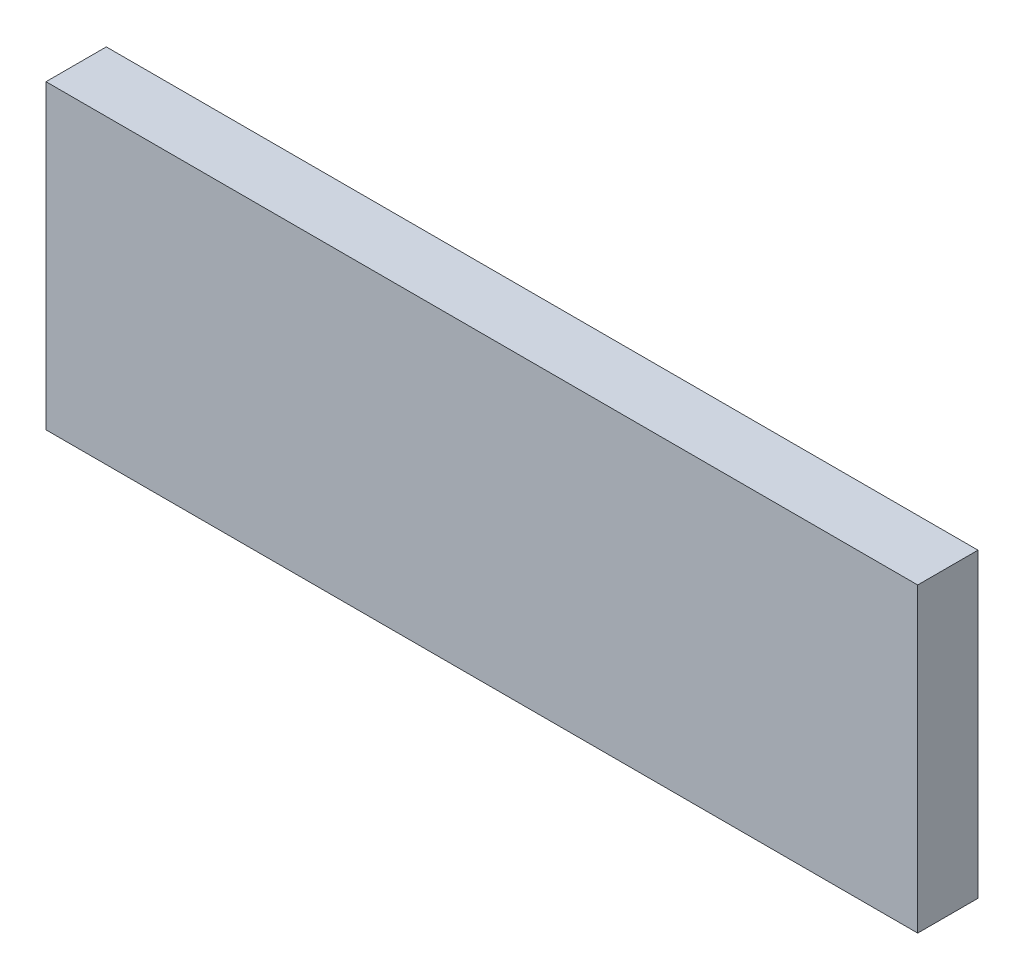
ISO-10303-21;
HEADER;
FILE_DESCRIPTION(('STEP AP214'),'2;1');
FILE_NAME('part.step','',(''),(''),'','','');
FILE_SCHEMA(('AUTOMOTIVE_DESIGN { 1 0 10303 214 1 1 1 1 }'));
ENDSEC;
DATA;
#1=APPLICATION_CONTEXT('core data for automotive mechanical design processes');
#2=APPLICATION_PROTOCOL_DEFINITION('international standard','automotive_design',2000,#1);
#3=PRODUCT_CONTEXT('',#1,'mechanical');
#4=PRODUCT('Part','Part','',(#3));
#5=PRODUCT_RELATED_PRODUCT_CATEGORY('part','',(#4));
#6=PRODUCT_DEFINITION_FORMATION('','',#4);
#7=PRODUCT_DEFINITION_CONTEXT('part definition',#1,'design');
#8=PRODUCT_DEFINITION('design','',#6,#7);
#9=PRODUCT_DEFINITION_SHAPE('','',#8);
#10=(LENGTH_UNIT() NAMED_UNIT(*) SI_UNIT(.MILLI.,.METRE.));
#11=(NAMED_UNIT(*) PLANE_ANGLE_UNIT() SI_UNIT($,.RADIAN.));
#12=(NAMED_UNIT(*) SI_UNIT($,.STERADIAN.) SOLID_ANGLE_UNIT());
#13=UNCERTAINTY_MEASURE_WITH_UNIT(LENGTH_MEASURE(1.E-05),#10,'distance_accuracy_value','');
#14=(GEOMETRIC_REPRESENTATION_CONTEXT(3) GLOBAL_UNCERTAINTY_ASSIGNED_CONTEXT((#13)) GLOBAL_UNIT_ASSIGNED_CONTEXT((#10,
#11,#12)) REPRESENTATION_CONTEXT('',''));
#15=CARTESIAN_POINT('',(0.,0.,0.));
#16=DIRECTION('',(0.,0.,1.));
#17=DIRECTION('',(1.,0.,0.));
#18=AXIS2_PLACEMENT_3D('',#15,#16,#17);
#19=CARTESIAN_POINT('',(1.80691028,-0.62500002,0.25000204));
#20=DIRECTION('',(0.,0.,1.));
#21=DIRECTION('',(1.,0.,0.));
#22=AXIS2_PLACEMENT_3D('',#19,#20,#21);
#23=PLANE('',#22);
#24=DIRECTION('',(0.,-1.,0.));
#25=VECTOR('',#24,1.);
#26=CARTESIAN_POINT('',(1.80691028,0.62500002,0.25000204));
#27=LINE('',#26,#25);
#28=CARTESIAN_POINT('',(1.80691028,0.62500002,0.25000204));
#29=VERTEX_POINT('',#28);
#30=CARTESIAN_POINT('',(1.80691028,-0.62500002,0.25000204));
#31=VERTEX_POINT('',#30);
#32=EDGE_CURVE('E28',#29,#31,#27,.T.);
#33=ORIENTED_EDGE('',*,*,#32,.F.);
#34=DIRECTION('',(1.,0.,0.));
#35=VECTOR('',#34,1.);
#36=CARTESIAN_POINT('',(-1.80690774,0.62500002,0.25000204));
#37=LINE('',#36,#35);
#38=CARTESIAN_POINT('',(-1.80690774,0.62500002,0.25000204));
#39=VERTEX_POINT('',#38);
#40=EDGE_CURVE('E99',#39,#29,#37,.T.);
#41=ORIENTED_EDGE('',*,*,#40,.F.);
#42=DIRECTION('',(0.,1.,0.));
#43=VECTOR('',#42,1.);
#44=CARTESIAN_POINT('',(-1.80690774,-0.62500002,0.25000204));
#45=LINE('',#44,#43);
#46=CARTESIAN_POINT('',(-1.80690774,-0.62500002,0.25000204));
#47=VERTEX_POINT('',#46);
#48=EDGE_CURVE('E70',#47,#39,#45,.T.);
#49=ORIENTED_EDGE('',*,*,#48,.F.);
#50=DIRECTION('',(-1.,0.,0.));
#51=VECTOR('',#50,1.);
#52=CARTESIAN_POINT('',(1.80691028,-0.62500002,0.25000204));
#53=LINE('',#52,#51);
#54=EDGE_CURVE('E90',#31,#47,#53,.T.);
#55=ORIENTED_EDGE('',*,*,#54,.F.);
#56=EDGE_LOOP('',(#33,#41,#49,#55));
#57=FACE_BOUND('',#56,.T.);
#58=ADVANCED_FACE('F17',(#57),#23,.T.);
#59=CARTESIAN_POINT('',(1.80691028,-0.62500002,0.));
#60=DIRECTION('',(0.,0.,1.));
#61=DIRECTION('',(1.,0.,0.));
#62=AXIS2_PLACEMENT_3D('',#59,#60,#61);
#63=PLANE('',#62);
#64=DIRECTION('',(-1.,0.,0.));
#65=VECTOR('',#64,1.);
#66=CARTESIAN_POINT('',(1.80691028,-0.62500002,0.));
#67=LINE('',#66,#65);
#68=CARTESIAN_POINT('',(1.80691028,-0.62500002,0.));
#69=VERTEX_POINT('',#68);
#70=CARTESIAN_POINT('',(-1.80690774,-0.62500002,0.));
#71=VERTEX_POINT('',#70);
#72=EDGE_CURVE('E76',#69,#71,#67,.T.);
#73=ORIENTED_EDGE('',*,*,#72,.T.);
#74=DIRECTION('',(0.,1.,0.));
#75=VECTOR('',#74,1.);
#76=CARTESIAN_POINT('',(-1.80690774,-0.62500002,0.));
#77=LINE('',#76,#75);
#78=CARTESIAN_POINT('',(-1.80690774,0.62500002,0.));
#79=VERTEX_POINT('',#78);
#80=EDGE_CURVE('E57',#71,#79,#77,.T.);
#81=ORIENTED_EDGE('',*,*,#80,.T.);
#82=DIRECTION('',(1.,0.,0.));
#83=VECTOR('',#82,1.);
#84=CARTESIAN_POINT('',(-1.80690774,0.62500002,0.));
#85=LINE('',#84,#83);
#86=CARTESIAN_POINT('',(1.80691028,0.62500002,0.));
#87=VERTEX_POINT('',#86);
#88=EDGE_CURVE('E21',#79,#87,#85,.T.);
#89=ORIENTED_EDGE('',*,*,#88,.T.);
#90=DIRECTION('',(0.,-1.,0.));
#91=VECTOR('',#90,1.);
#92=CARTESIAN_POINT('',(1.80691028,0.62500002,0.));
#93=LINE('',#92,#91);
#94=EDGE_CURVE('E11',#87,#69,#93,.T.);
#95=ORIENTED_EDGE('',*,*,#94,.T.);
#96=EDGE_LOOP('',(#73,#81,#89,#95));
#97=FACE_BOUND('',#96,.T.);
#98=ADVANCED_FACE('F19',(#97),#63,.F.);
#99=CARTESIAN_POINT('',(1.80691028,0.62500002,0.));
#100=DIRECTION('',(1.,0.,0.));
#101=DIRECTION('',(0.,1.,0.));
#102=AXIS2_PLACEMENT_3D('',#99,#100,#101);
#103=PLANE('',#102);
#104=DIRECTION('',(0.,0.,1.));
#105=VECTOR('',#104,1.);
#106=CARTESIAN_POINT('',(1.80691028,0.62500002,0.));
#107=LINE('',#106,#105);
#108=EDGE_CURVE('E107',#87,#29,#107,.T.);
#109=ORIENTED_EDGE('',*,*,#108,.T.);
#110=ORIENTED_EDGE('',*,*,#32,.T.);
#111=DIRECTION('',(0.,0.,1.));
#112=VECTOR('',#111,1.);
#113=CARTESIAN_POINT('',(1.80691028,-0.62500002,0.));
#114=LINE('',#113,#112);
#115=EDGE_CURVE('E84',#69,#31,#114,.T.);
#116=ORIENTED_EDGE('',*,*,#115,.F.);
#117=ORIENTED_EDGE('',*,*,#94,.F.);
#118=EDGE_LOOP('',(#109,#110,#116,#117));
#119=FACE_BOUND('',#118,.T.);
#120=ADVANCED_FACE('F88',(#119),#103,.T.);
#121=CARTESIAN_POINT('',(-1.80690774,0.62500002,0.));
#122=DIRECTION('',(0.,1.,0.));
#123=DIRECTION('',(1.,0.,0.));
#124=AXIS2_PLACEMENT_3D('',#121,#122,#123);
#125=PLANE('',#124);
#126=DIRECTION('',(0.,0.,1.));
#127=VECTOR('',#126,1.);
#128=CARTESIAN_POINT('',(-1.80690774,0.62500002,0.));
#129=LINE('',#128,#127);
#130=EDGE_CURVE('E118',#79,#39,#129,.T.);
#131=ORIENTED_EDGE('',*,*,#130,.T.);
#132=ORIENTED_EDGE('',*,*,#40,.T.);
#133=ORIENTED_EDGE('',*,*,#108,.F.);
#134=ORIENTED_EDGE('',*,*,#88,.F.);
#135=EDGE_LOOP('',(#131,#132,#133,#134));
#136=FACE_BOUND('',#135,.T.);
#137=ADVANCED_FACE('F129',(#136),#125,.T.);
#138=CARTESIAN_POINT('',(-1.80690774,-0.62500002,0.));
#139=DIRECTION('',(-1.,0.,0.));
#140=DIRECTION('',(0.,0.,1.));
#141=AXIS2_PLACEMENT_3D('',#138,#139,#140);
#142=PLANE('',#141);
#143=DIRECTION('',(0.,0.,1.));
#144=VECTOR('',#143,1.);
#145=CARTESIAN_POINT('',(-1.80690774,-0.62500002,0.));
#146=LINE('',#145,#144);
#147=EDGE_CURVE('E85',#71,#47,#146,.T.);
#148=ORIENTED_EDGE('',*,*,#147,.T.);
#149=ORIENTED_EDGE('',*,*,#48,.T.);
#150=ORIENTED_EDGE('',*,*,#130,.F.);
#151=ORIENTED_EDGE('',*,*,#80,.F.);
#152=EDGE_LOOP('',(#148,#149,#150,#151));
#153=FACE_BOUND('',#152,.T.);
#154=ADVANCED_FACE('F128',(#153),#142,.T.);
#155=CARTESIAN_POINT('',(1.80691028,-0.62500002,0.));
#156=DIRECTION('',(0.,-1.,0.));
#157=DIRECTION('',(0.,0.,-1.));
#158=AXIS2_PLACEMENT_3D('',#155,#156,#157);
#159=PLANE('',#158);
#160=ORIENTED_EDGE('',*,*,#115,.T.);
#161=ORIENTED_EDGE('',*,*,#54,.T.);
#162=ORIENTED_EDGE('',*,*,#147,.F.);
#163=ORIENTED_EDGE('',*,*,#72,.F.);
#164=EDGE_LOOP('',(#160,#161,#162,#163));
#165=FACE_BOUND('',#164,.T.);
#166=ADVANCED_FACE('F82',(#165),#159,.T.);
#167=CLOSED_SHELL('',(#58,#98,#120,#137,#154,#166));
#168=MANIFOLD_SOLID_BREP('B1',#167);
#169=ADVANCED_BREP_SHAPE_REPRESENTATION('',(#18,#168),#14);
#170=SHAPE_DEFINITION_REPRESENTATION(#9,#169);
ENDSEC;
END-ISO-10303-21;
